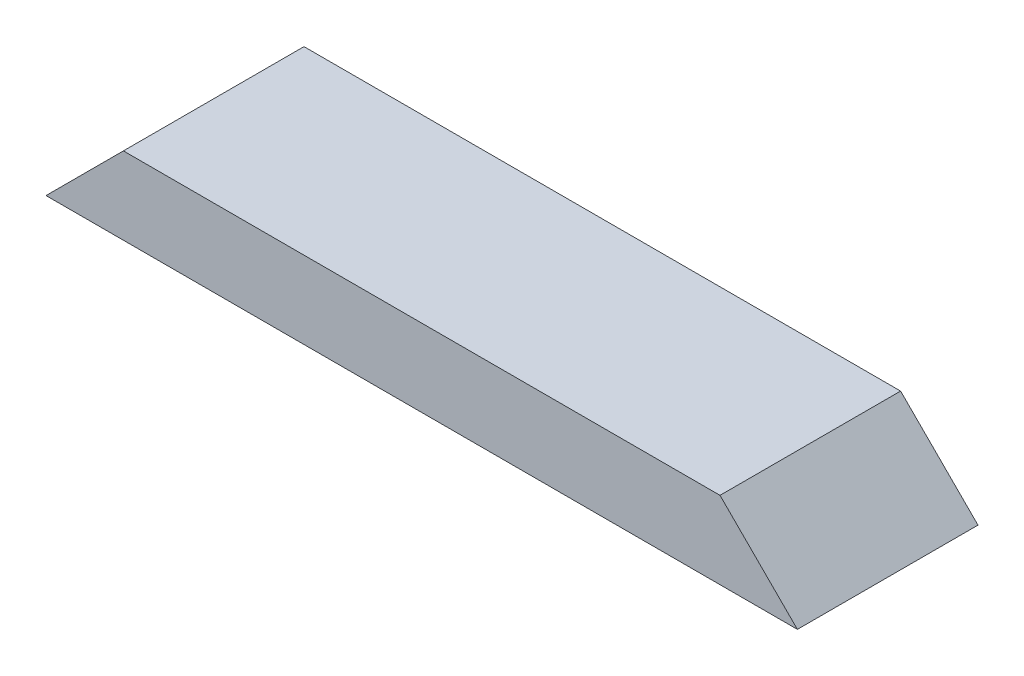
ISO-10303-21;
HEADER;
FILE_DESCRIPTION(('STEP AP214'),'2;1');
FILE_NAME('part.step','',(''),(''),'','','');
FILE_SCHEMA(('AUTOMOTIVE_DESIGN { 1 0 10303 214 1 1 1 1 }'));
ENDSEC;
DATA;
#1=APPLICATION_CONTEXT('core data for automotive mechanical design processes');
#2=APPLICATION_PROTOCOL_DEFINITION('international standard','automotive_design',2000,#1);
#3=PRODUCT_CONTEXT('',#1,'mechanical');
#4=PRODUCT('Part','Part','',(#3));
#5=PRODUCT_RELATED_PRODUCT_CATEGORY('part','',(#4));
#6=PRODUCT_DEFINITION_FORMATION('','',#4);
#7=PRODUCT_DEFINITION_CONTEXT('part definition',#1,'design');
#8=PRODUCT_DEFINITION('design','',#6,#7);
#9=PRODUCT_DEFINITION_SHAPE('','',#8);
#10=(LENGTH_UNIT() NAMED_UNIT(*) SI_UNIT(.MILLI.,.METRE.));
#11=(NAMED_UNIT(*) PLANE_ANGLE_UNIT() SI_UNIT($,.RADIAN.));
#12=(NAMED_UNIT(*) SI_UNIT($,.STERADIAN.) SOLID_ANGLE_UNIT());
#13=UNCERTAINTY_MEASURE_WITH_UNIT(LENGTH_MEASURE(1.E-05),#10,'distance_accuracy_value','');
#14=(GEOMETRIC_REPRESENTATION_CONTEXT(3) GLOBAL_UNCERTAINTY_ASSIGNED_CONTEXT((#13)) GLOBAL_UNIT_ASSIGNED_CONTEXT((#10,
#11,#12)) REPRESENTATION_CONTEXT('',''));
#15=CARTESIAN_POINT('',(0.,0.,0.));
#16=DIRECTION('',(0.,0.,1.));
#17=DIRECTION('',(1.,0.,0.));
#18=AXIS2_PLACEMENT_3D('',#15,#16,#17);
#19=CARTESIAN_POINT('',(0.,38.1,0.));
#20=DIRECTION('',(0.,0.,-1.));
#21=DIRECTION('',(-1.,0.,0.));
#22=AXIS2_PLACEMENT_3D('',#19,#20,#21);
#23=PLANE('',#22);
#24=DIRECTION('',(1.,0.,0.));
#25=VECTOR('',#24,1.);
#26=CARTESIAN_POINT('',(0.,38.1,0.));
#27=LINE('',#26,#25);
#28=CARTESIAN_POINT('',(38.1,38.1,0.));
#29=VERTEX_POINT('',#28);
#30=CARTESIAN_POINT('',(331.7875,38.0999999999999,0.));
#31=VERTEX_POINT('',#30);
#32=EDGE_CURVE('E47',#29,#31,#27,.T.);
#33=ORIENTED_EDGE('',*,*,#32,.F.);
#34=DIRECTION('',(0.707106781186547,0.707106781186547,0.));
#35=VECTOR('',#34,1.);
#36=CARTESIAN_POINT('',(0.,0.,0.));
#37=LINE('',#36,#35);
#38=CARTESIAN_POINT('',(0.,0.,0.));
#39=VERTEX_POINT('',#38);
#40=EDGE_CURVE('E82',#39,#29,#37,.T.);
#41=ORIENTED_EDGE('',*,*,#40,.F.);
#42=DIRECTION('',(1.,0.,0.));
#43=VECTOR('',#42,1.);
#44=CARTESIAN_POINT('',(0.,0.,0.));
#45=LINE('',#44,#43);
#46=CARTESIAN_POINT('',(369.8875,0.,0.));
#47=VERTEX_POINT('',#46);
#48=EDGE_CURVE('E87',#39,#47,#45,.T.);
#49=ORIENTED_EDGE('',*,*,#48,.T.);
#50=DIRECTION('',(0.707106781186549,-0.707106781186546,0.));
#51=VECTOR('',#50,1.);
#52=CARTESIAN_POINT('',(331.7875,38.0999999999999,0.));
#53=LINE('',#52,#51);
#54=EDGE_CURVE('E63',#31,#47,#53,.T.);
#55=ORIENTED_EDGE('',*,*,#54,.F.);
#56=EDGE_LOOP('',(#33,#41,#49,#55));
#57=FACE_BOUND('',#56,.T.);
#58=ADVANCED_FACE('F39',(#57),#23,.F.);
#59=CARTESIAN_POINT('',(0.,38.1,-88.9));
#60=DIRECTION('',(0.,0.,1.));
#61=DIRECTION('',(1.,0.,0.));
#62=AXIS2_PLACEMENT_3D('',#59,#60,#61);
#63=PLANE('',#62);
#64=DIRECTION('',(-1.,0.,0.));
#65=VECTOR('',#64,1.);
#66=CARTESIAN_POINT('',(0.,0.,-88.9));
#67=LINE('',#66,#65);
#68=CARTESIAN_POINT('',(369.8875,0.,-88.9));
#69=VERTEX_POINT('',#68);
#70=CARTESIAN_POINT('',(0.,0.,-88.9));
#71=VERTEX_POINT('',#70);
#72=EDGE_CURVE('E42',#69,#71,#67,.T.);
#73=ORIENTED_EDGE('',*,*,#72,.T.);
#74=DIRECTION('',(0.707106781186547,0.707106781186547,0.));
#75=VECTOR('',#74,1.);
#76=CARTESIAN_POINT('',(0.,0.,-88.9));
#77=LINE('',#76,#75);
#78=CARTESIAN_POINT('',(38.1,38.1,-88.9));
#79=VERTEX_POINT('',#78);
#80=EDGE_CURVE('E55',#71,#79,#77,.T.);
#81=ORIENTED_EDGE('',*,*,#80,.T.);
#82=DIRECTION('',(-1.,0.,0.));
#83=VECTOR('',#82,1.);
#84=CARTESIAN_POINT('',(0.,38.1,-88.9));
#85=LINE('',#84,#83);
#86=CARTESIAN_POINT('',(331.7875,38.0999999999999,-88.9));
#87=VERTEX_POINT('',#86);
#88=EDGE_CURVE('E11',#87,#79,#85,.T.);
#89=ORIENTED_EDGE('',*,*,#88,.F.);
#90=DIRECTION('',(0.707106781186549,-0.707106781186546,0.));
#91=VECTOR('',#90,1.);
#92=CARTESIAN_POINT('',(331.7875,38.0999999999999,-88.9));
#93=LINE('',#92,#91);
#94=EDGE_CURVE('E100',#87,#69,#93,.T.);
#95=ORIENTED_EDGE('',*,*,#94,.T.);
#96=EDGE_LOOP('',(#73,#81,#89,#95));
#97=FACE_BOUND('',#96,.T.);
#98=ADVANCED_FACE('F109',(#97),#63,.F.);
#99=CARTESIAN_POINT('',(0.,38.1,0.));
#100=DIRECTION('',(0.,-1.,0.));
#101=DIRECTION('',(0.,0.,-1.));
#102=AXIS2_PLACEMENT_3D('',#99,#100,#101);
#103=PLANE('',#102);
#104=ORIENTED_EDGE('',*,*,#88,.T.);
#105=DIRECTION('',(0.,0.,1.));
#106=VECTOR('',#105,1.);
#107=CARTESIAN_POINT('',(38.1,38.1,-88.9));
#108=LINE('',#107,#106);
#109=EDGE_CURVE('E88',#79,#29,#108,.T.);
#110=ORIENTED_EDGE('',*,*,#109,.T.);
#111=ORIENTED_EDGE('',*,*,#32,.T.);
#112=DIRECTION('',(0.,0.,1.));
#113=VECTOR('',#112,1.);
#114=CARTESIAN_POINT('',(331.7875,38.0999999999999,-88.9));
#115=LINE('',#114,#113);
#116=EDGE_CURVE('E103',#87,#31,#115,.T.);
#117=ORIENTED_EDGE('',*,*,#116,.F.);
#118=EDGE_LOOP('',(#104,#110,#111,#117));
#119=FACE_BOUND('',#118,.T.);
#120=ADVANCED_FACE('F112',(#119),#103,.F.);
#121=CARTESIAN_POINT('',(0.,0.,0.));
#122=DIRECTION('',(0.,-1.,0.));
#123=DIRECTION('',(0.,0.,-1.));
#124=AXIS2_PLACEMENT_3D('',#121,#122,#123);
#125=PLANE('',#124);
#126=DIRECTION('',(0.,0.,1.));
#127=VECTOR('',#126,1.);
#128=CARTESIAN_POINT('',(0.,0.,0.));
#129=LINE('',#128,#127);
#130=EDGE_CURVE('E79',#71,#39,#129,.T.);
#131=ORIENTED_EDGE('',*,*,#130,.F.);
#132=ORIENTED_EDGE('',*,*,#72,.F.);
#133=DIRECTION('',(0.,0.,-1.));
#134=VECTOR('',#133,1.);
#135=CARTESIAN_POINT('',(369.8875,0.,0.));
#136=LINE('',#135,#134);
#137=EDGE_CURVE('E96',#47,#69,#136,.T.);
#138=ORIENTED_EDGE('',*,*,#137,.F.);
#139=ORIENTED_EDGE('',*,*,#48,.F.);
#140=EDGE_LOOP('',(#131,#132,#138,#139));
#141=FACE_BOUND('',#140,.T.);
#142=ADVANCED_FACE('F95',(#141),#125,.T.);
#143=CARTESIAN_POINT('',(331.7875,38.0999999999999,-88.9));
#144=DIRECTION('',(-0.707106781186546,-0.707106781186549,0.));
#145=DIRECTION('',(0.707106781186549,-0.707106781186546,0.));
#146=AXIS2_PLACEMENT_3D('',#143,#144,#145);
#147=PLANE('',#146);
#148=ORIENTED_EDGE('',*,*,#54,.T.);
#149=ORIENTED_EDGE('',*,*,#137,.T.);
#150=ORIENTED_EDGE('',*,*,#94,.F.);
#151=ORIENTED_EDGE('',*,*,#116,.T.);
#152=EDGE_LOOP('',(#148,#149,#150,#151));
#153=FACE_BOUND('',#152,.T.);
#154=ADVANCED_FACE('F113',(#153),#147,.F.);
#155=CARTESIAN_POINT('',(0.,0.,-88.9));
#156=DIRECTION('',(0.707106781186547,-0.707106781186547,0.));
#157=DIRECTION('',(0.707106781186548,0.707106781186548,0.));
#158=AXIS2_PLACEMENT_3D('',#155,#156,#157);
#159=PLANE('',#158);
#160=ORIENTED_EDGE('',*,*,#40,.T.);
#161=ORIENTED_EDGE('',*,*,#109,.F.);
#162=ORIENTED_EDGE('',*,*,#80,.F.);
#163=ORIENTED_EDGE('',*,*,#130,.T.);
#164=EDGE_LOOP('',(#160,#161,#162,#163));
#165=FACE_BOUND('',#164,.T.);
#166=ADVANCED_FACE('F81',(#165),#159,.F.);
#167=CLOSED_SHELL('',(#58,#98,#120,#142,#154,#166));
#168=MANIFOLD_SOLID_BREP('B2',#167);
#169=ADVANCED_BREP_SHAPE_REPRESENTATION('',(#18,#168),#14);
#170=SHAPE_DEFINITION_REPRESENTATION(#9,#169);
ENDSEC;
END-ISO-10303-21;
